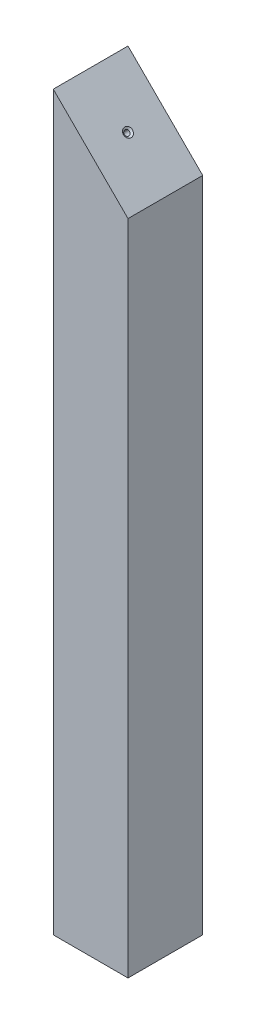
ISO-10303-21;
HEADER;
FILE_DESCRIPTION(('STEP AP214'),'2;1');
FILE_NAME('part.step','',(''),(''),'','','');
FILE_SCHEMA(('AUTOMOTIVE_DESIGN { 1 0 10303 214 1 1 1 1 }'));
ENDSEC;
DATA;
#1=APPLICATION_CONTEXT('core data for automotive mechanical design processes');
#2=APPLICATION_PROTOCOL_DEFINITION('international standard','automotive_design',2000,#1);
#3=PRODUCT_CONTEXT('',#1,'mechanical');
#4=PRODUCT('Part','Part','',(#3));
#5=PRODUCT_RELATED_PRODUCT_CATEGORY('part','',(#4));
#6=PRODUCT_DEFINITION_FORMATION('','',#4);
#7=PRODUCT_DEFINITION_CONTEXT('part definition',#1,'design');
#8=PRODUCT_DEFINITION('design','',#6,#7);
#9=PRODUCT_DEFINITION_SHAPE('','',#8);
#10=(LENGTH_UNIT() NAMED_UNIT(*) SI_UNIT(.MILLI.,.METRE.));
#11=(NAMED_UNIT(*) PLANE_ANGLE_UNIT() SI_UNIT($,.RADIAN.));
#12=(NAMED_UNIT(*) SI_UNIT($,.STERADIAN.) SOLID_ANGLE_UNIT());
#13=UNCERTAINTY_MEASURE_WITH_UNIT(LENGTH_MEASURE(1.E-05),#10,'distance_accuracy_value','');
#14=(GEOMETRIC_REPRESENTATION_CONTEXT(3) GLOBAL_UNCERTAINTY_ASSIGNED_CONTEXT((#13)) GLOBAL_UNIT_ASSIGNED_CONTEXT((#10,
#11,#12)) REPRESENTATION_CONTEXT('',''));
#15=CARTESIAN_POINT('',(0.,0.,0.));
#16=DIRECTION('',(0.,0.,1.));
#17=DIRECTION('',(1.,0.,0.));
#18=AXIS2_PLACEMENT_3D('',#15,#16,#17);
#19=CARTESIAN_POINT('',(12.7,124.485,-12.7));
#20=DIRECTION('',(-1.,0.,0.));
#21=DIRECTION('',(0.,0.,1.));
#22=AXIS2_PLACEMENT_3D('',#19,#20,#21);
#23=PLANE('',#22);
#24=DIRECTION('',(0.,-1.,0.));
#25=VECTOR('',#24,1.);
#26=CARTESIAN_POINT('',(12.7,124.485,-12.7));
#27=LINE('',#26,#25);
#28=CARTESIAN_POINT('',(12.7,99.0850000000001,-12.7));
#29=VERTEX_POINT('',#28);
#30=CARTESIAN_POINT('',(12.7,-124.485,-12.7));
#31=VERTEX_POINT('',#30);
#32=EDGE_CURVE('E11',#29,#31,#27,.T.);
#33=ORIENTED_EDGE('',*,*,#32,.F.);
#34=DIRECTION('',(0.,0.,1.));
#35=VECTOR('',#34,1.);
#36=CARTESIAN_POINT('',(12.7,99.0850000000001,-12.7));
#37=LINE('',#36,#35);
#38=CARTESIAN_POINT('',(12.7,99.0850000000001,12.7));
#39=VERTEX_POINT('',#38);
#40=EDGE_CURVE('E103',#29,#39,#37,.T.);
#41=ORIENTED_EDGE('',*,*,#40,.T.);
#42=DIRECTION('',(0.,-1.,0.));
#43=VECTOR('',#42,1.);
#44=CARTESIAN_POINT('',(12.7,124.485,12.7));
#45=LINE('',#44,#43);
#46=CARTESIAN_POINT('',(12.7,-124.485,12.7));
#47=VERTEX_POINT('',#46);
#48=EDGE_CURVE('E89',#39,#47,#45,.T.);
#49=ORIENTED_EDGE('',*,*,#48,.T.);
#50=DIRECTION('',(0.,0.,-1.));
#51=VECTOR('',#50,1.);
#52=CARTESIAN_POINT('',(12.7,-124.485,-12.7));
#53=LINE('',#52,#51);
#54=EDGE_CURVE('E93',#47,#31,#53,.T.);
#55=ORIENTED_EDGE('',*,*,#54,.T.);
#56=EDGE_LOOP('',(#33,#41,#49,#55));
#57=FACE_BOUND('',#56,.T.);
#58=ADVANCED_FACE('F37',(#57),#23,.F.);
#59=CARTESIAN_POINT('',(-12.7,124.485,-12.7));
#60=DIRECTION('',(0.,0.,1.));
#61=DIRECTION('',(1.,0.,0.));
#62=AXIS2_PLACEMENT_3D('',#59,#60,#61);
#63=PLANE('',#62);
#64=DIRECTION('',(0.,-1.,0.));
#65=VECTOR('',#64,1.);
#66=CARTESIAN_POINT('',(-12.7,124.485,-12.7));
#67=LINE('',#66,#65);
#68=CARTESIAN_POINT('',(-12.7,124.485,-12.7));
#69=VERTEX_POINT('',#68);
#70=CARTESIAN_POINT('',(-12.7,-124.485,-12.7));
#71=VERTEX_POINT('',#70);
#72=EDGE_CURVE('E45',#69,#71,#67,.T.);
#73=ORIENTED_EDGE('',*,*,#72,.F.);
#74=DIRECTION('',(0.707106781186549,-0.707106781186546,0.));
#75=VECTOR('',#74,1.);
#76=CARTESIAN_POINT('',(-12.7,124.485,-12.7));
#77=LINE('',#76,#75);
#78=EDGE_CURVE('E52',#69,#29,#77,.T.);
#79=ORIENTED_EDGE('',*,*,#78,.T.);
#80=ORIENTED_EDGE('',*,*,#32,.T.);
#81=DIRECTION('',(-1.,0.,0.));
#82=VECTOR('',#81,1.);
#83=CARTESIAN_POINT('',(-12.7,-124.485,-12.7));
#84=LINE('',#83,#82);
#85=EDGE_CURVE('E79',#31,#71,#84,.T.);
#86=ORIENTED_EDGE('',*,*,#85,.T.);
#87=EDGE_LOOP('',(#73,#79,#80,#86));
#88=FACE_BOUND('',#87,.T.);
#89=ADVANCED_FACE('F141',(#88),#63,.F.);
#90=CARTESIAN_POINT('',(-12.7,124.485,-12.7));
#91=DIRECTION('',(1.,0.,0.));
#92=DIRECTION('',(0.,0.,-1.));
#93=AXIS2_PLACEMENT_3D('',#90,#91,#92);
#94=PLANE('',#93);
#95=DIRECTION('',(0.,0.,1.));
#96=VECTOR('',#95,1.);
#97=CARTESIAN_POINT('',(-12.7,-124.485,-12.7));
#98=LINE('',#97,#96);
#99=CARTESIAN_POINT('',(-12.7,-124.485,12.7));
#100=VERTEX_POINT('',#99);
#101=EDGE_CURVE('E69',#71,#100,#98,.T.);
#102=ORIENTED_EDGE('',*,*,#101,.T.);
#103=DIRECTION('',(0.,-1.,0.));
#104=VECTOR('',#103,1.);
#105=CARTESIAN_POINT('',(-12.7,124.485,12.7));
#106=LINE('',#105,#104);
#107=CARTESIAN_POINT('',(-12.7,124.485,12.7));
#108=VERTEX_POINT('',#107);
#109=EDGE_CURVE('E74',#108,#100,#106,.T.);
#110=ORIENTED_EDGE('',*,*,#109,.F.);
#111=DIRECTION('',(0.,0.,1.));
#112=VECTOR('',#111,1.);
#113=CARTESIAN_POINT('',(-12.7,124.485,-12.7));
#114=LINE('',#113,#112);
#115=EDGE_CURVE('E94',#69,#108,#114,.T.);
#116=ORIENTED_EDGE('',*,*,#115,.F.);
#117=ORIENTED_EDGE('',*,*,#72,.T.);
#118=EDGE_LOOP('',(#102,#110,#116,#117));
#119=FACE_BOUND('',#118,.T.);
#120=ADVANCED_FACE('F71',(#119),#94,.F.);
#121=CARTESIAN_POINT('',(-12.7,124.485,12.7));
#122=DIRECTION('',(0.,0.,-1.));
#123=DIRECTION('',(-1.,0.,0.));
#124=AXIS2_PLACEMENT_3D('',#121,#122,#123);
#125=PLANE('',#124);
#126=ORIENTED_EDGE('',*,*,#48,.F.);
#127=DIRECTION('',(0.707106781186549,-0.707106781186546,0.));
#128=VECTOR('',#127,1.);
#129=CARTESIAN_POINT('',(-12.7,124.485,12.7));
#130=LINE('',#129,#128);
#131=EDGE_CURVE('E88',#108,#39,#130,.T.);
#132=ORIENTED_EDGE('',*,*,#131,.F.);
#133=ORIENTED_EDGE('',*,*,#109,.T.);
#134=DIRECTION('',(1.,0.,0.));
#135=VECTOR('',#134,1.);
#136=CARTESIAN_POINT('',(-12.7,-124.485,12.7));
#137=LINE('',#136,#135);
#138=EDGE_CURVE('E78',#100,#47,#137,.T.);
#139=ORIENTED_EDGE('',*,*,#138,.T.);
#140=EDGE_LOOP('',(#126,#132,#133,#139));
#141=FACE_BOUND('',#140,.T.);
#142=ADVANCED_FACE('F85',(#141),#125,.F.);
#143=CARTESIAN_POINT('',(0.,-124.485,0.));
#144=DIRECTION('',(0.,1.,0.));
#145=DIRECTION('',(0.,0.,1.));
#146=AXIS2_PLACEMENT_3D('',#143,#144,#145);
#147=PLANE('',#146);
#148=CARTESIAN_POINT('',(0.,-124.485,0.));
#149=DIRECTION('',(0.,-1.,0.));
#150=DIRECTION('',(0.,0.,-1.));
#151=AXIS2_PLACEMENT_3D('',#148,#149,#150);
#152=CIRCLE('',#151,1.5113);
#153=CARTESIAN_POINT('',(0.,-124.485,-1.5113));
#154=VERTEX_POINT('',#153);
#155=EDGE_CURVE('E131',#154,#154,#152,.T.);
#156=ORIENTED_EDGE('',*,*,#155,.F.);
#157=EDGE_LOOP('',(#156));
#158=FACE_BOUND('',#157,.T.);
#159=ORIENTED_EDGE('',*,*,#54,.F.);
#160=ORIENTED_EDGE('',*,*,#138,.F.);
#161=ORIENTED_EDGE('',*,*,#101,.F.);
#162=ORIENTED_EDGE('',*,*,#85,.F.);
#163=EDGE_LOOP('',(#159,#160,#161,#162));
#164=FACE_BOUND('',#163,.T.);
#165=ADVANCED_FACE('F91',(#158,#164),#147,.F.);
#166=CARTESIAN_POINT('',(0.,-104.485,0.));
#167=DIRECTION('',(0.,-1.,0.));
#168=DIRECTION('',(0.,0.,-1.));
#169=AXIS2_PLACEMENT_3D('',#166,#167,#168);
#170=CONICAL_SURFACE('',#169,0.595629999999985,1.02974425867665);
#171=CARTESIAN_POINT('',(0.,-104.127109389489,0.));
#172=VERTEX_POINT('',#171);
#173=VERTEX_LOOP('',#172);
#174=FACE_BOUND('',#173,.T.);
#175=CARTESIAN_POINT('',(0.,-104.485,0.));
#176=DIRECTION('',(0.,-1.,0.));
#177=DIRECTION('',(0.,0.,-1.));
#178=AXIS2_PLACEMENT_3D('',#175,#176,#177);
#179=CIRCLE('',#178,0.595629999999985);
#180=CARTESIAN_POINT('',(0.,-104.485,-0.595629999999985));
#181=VERTEX_POINT('',#180);
#182=EDGE_CURVE('E137',#181,#181,#179,.T.);
#183=ORIENTED_EDGE('',*,*,#182,.T.);
#184=EDGE_LOOP('',(#183));
#185=FACE_BOUND('',#184,.T.);
#186=ADVANCED_FACE('F166',(#174,#185),#170,.F.);
#187=CARTESIAN_POINT('',(0.,-124.485,0.));
#188=DIRECTION('',(0.,-1.,0.));
#189=DIRECTION('',(0.,0.,-1.));
#190=AXIS2_PLACEMENT_3D('',#187,#188,#189);
#191=CYLINDRICAL_SURFACE('',#190,0.595629999999987);
#192=ORIENTED_EDGE('',*,*,#182,.F.);
#193=EDGE_LOOP('',(#192));
#194=FACE_BOUND('',#193,.T.);
#195=CARTESIAN_POINT('',(0.,-123.71666164072,0.));
#196=DIRECTION('',(0.,-1.,0.));
#197=DIRECTION('',(0.,0.,-1.));
#198=AXIS2_PLACEMENT_3D('',#195,#196,#197);
#199=CIRCLE('',#198,0.595629999999989);
#200=CARTESIAN_POINT('',(0.,-123.71666164072,-0.595629999999989));
#201=VERTEX_POINT('',#200);
#202=EDGE_CURVE('E134',#201,#201,#199,.T.);
#203=ORIENTED_EDGE('',*,*,#202,.T.);
#204=EDGE_LOOP('',(#203));
#205=FACE_BOUND('',#204,.T.);
#206=ADVANCED_FACE('F149',(#194,#205),#191,.F.);
#207=CARTESIAN_POINT('',(0.,-124.485,0.));
#208=DIRECTION('',(0.,-1.,0.));
#209=DIRECTION('',(0.,0.,-1.));
#210=AXIS2_PLACEMENT_3D('',#207,#208,#209);
#211=CONICAL_SURFACE('',#210,1.5113,0.872664625997162);
#212=ORIENTED_EDGE('',*,*,#202,.F.);
#213=EDGE_LOOP('',(#212));
#214=FACE_BOUND('',#213,.T.);
#215=ORIENTED_EDGE('',*,*,#155,.T.);
#216=EDGE_LOOP('',(#215));
#217=FACE_BOUND('',#216,.T.);
#218=ADVANCED_FACE('F143',(#214,#217),#211,.F.);
#219=CARTESIAN_POINT('',(-12.7,124.485,-12.7));
#220=DIRECTION('',(-0.707106781186546,-0.707106781186549,0.));
#221=DIRECTION('',(0.707106781186549,-0.707106781186546,0.));
#222=AXIS2_PLACEMENT_3D('',#219,#220,#221);
#223=PLANE('',#222);
#224=CARTESIAN_POINT('',(0.,111.785,0.));
#225=DIRECTION('',(0.707106781186546,0.707106781186549,0.));
#226=DIRECTION('',(-0.707106781186549,0.707106781186546,0.));
#227=AXIS2_PLACEMENT_3D('',#224,#225,#226);
#228=CIRCLE('',#227,1.5113);
#229=CARTESIAN_POINT('',(-1.06865047840724,112.853650478407,0.));
#230=VERTEX_POINT('',#229);
#231=EDGE_CURVE('E125',#230,#230,#228,.T.);
#232=ORIENTED_EDGE('',*,*,#231,.F.);
#233=EDGE_LOOP('',(#232));
#234=FACE_BOUND('',#233,.T.);
#235=ORIENTED_EDGE('',*,*,#40,.F.);
#236=ORIENTED_EDGE('',*,*,#78,.F.);
#237=ORIENTED_EDGE('',*,*,#115,.T.);
#238=ORIENTED_EDGE('',*,*,#131,.T.);
#239=EDGE_LOOP('',(#235,#236,#237,#238));
#240=FACE_BOUND('',#239,.T.);
#241=ADVANCED_FACE('F115',(#234,#240),#223,.F.);
#242=CARTESIAN_POINT('',(-7.07106781186547,104.713932188135,0.));
#243=DIRECTION('',(0.707106781186546,0.707106781186549,0.));
#244=DIRECTION('',(-0.707106781186549,0.707106781186546,0.));
#245=AXIS2_PLACEMENT_3D('',#242,#243,#244);
#246=CONICAL_SURFACE('',#245,0.888999999999996,1.02974425867666);
#247=CARTESIAN_POINT('',(-7.44877956950068,104.336220430499,0.));
#248=VERTEX_POINT('',#247);
#249=VERTEX_LOOP('',#248);
#250=FACE_BOUND('',#249,.T.);
#251=CARTESIAN_POINT('',(-7.07106781186547,104.713932188135,0.));
#252=DIRECTION('',(0.707106781186546,0.707106781186549,0.));
#253=DIRECTION('',(-0.707106781186549,0.707106781186546,0.));
#254=AXIS2_PLACEMENT_3D('',#251,#252,#253);
#255=CIRCLE('',#254,0.888999999999996);
#256=CARTESIAN_POINT('',(-7.69968574034031,105.342550116609,0.));
#257=VERTEX_POINT('',#256);
#258=EDGE_CURVE('E119',#257,#257,#255,.T.);
#259=ORIENTED_EDGE('',*,*,#258,.T.);
#260=EDGE_LOOP('',(#259));
#261=FACE_BOUND('',#260,.T.);
#262=ADVANCED_FACE('F111',(#250,#261),#246,.F.);
#263=CARTESIAN_POINT('',(0.,111.785,0.));
#264=DIRECTION('',(0.707106781186546,0.707106781186549,0.));
#265=DIRECTION('',(-0.707106781186549,0.707106781186546,0.));
#266=AXIS2_PLACEMENT_3D('',#263,#264,#265);
#267=CYLINDRICAL_SURFACE('',#266,0.888999999999996);
#268=ORIENTED_EDGE('',*,*,#258,.F.);
#269=EDGE_LOOP('',(#268));
#270=FACE_BOUND('',#269,.T.);
#271=CARTESIAN_POINT('',(-0.369231150354273,111.415768849646,0.));
#272=DIRECTION('',(0.707106781186546,0.707106781186549,0.));
#273=DIRECTION('',(-0.707106781186549,0.707106781186546,0.));
#274=AXIS2_PLACEMENT_3D('',#271,#272,#273);
#275=CIRCLE('',#274,0.888999999999996);
#276=CARTESIAN_POINT('',(-0.997849078829112,112.044386778121,0.));
#277=VERTEX_POINT('',#276);
#278=EDGE_CURVE('E121',#277,#277,#275,.T.);
#279=ORIENTED_EDGE('',*,*,#278,.T.);
#280=EDGE_LOOP('',(#279));
#281=FACE_BOUND('',#280,.T.);
#282=ADVANCED_FACE('F114',(#270,#281),#267,.F.);
#283=CARTESIAN_POINT('',(0.,111.785,0.));
#284=DIRECTION('',(0.707106781186546,0.707106781186549,0.));
#285=DIRECTION('',(-0.707106781186549,0.707106781186546,0.));
#286=AXIS2_PLACEMENT_3D('',#283,#284,#285);
#287=CONICAL_SURFACE('',#286,1.5113,0.872664625997165);
#288=ORIENTED_EDGE('',*,*,#278,.F.);
#289=EDGE_LOOP('',(#288));
#290=FACE_BOUND('',#289,.T.);
#291=ORIENTED_EDGE('',*,*,#231,.T.);
#292=EDGE_LOOP('',(#291));
#293=FACE_BOUND('',#292,.T.);
#294=ADVANCED_FACE('F230',(#290,#293),#287,.F.);
#295=CLOSED_SHELL('',(#58,#89,#120,#142,#165,#186,#206,#218,#241,#262,#282,#294));
#296=MANIFOLD_SOLID_BREP('B2',#295);
#297=ADVANCED_BREP_SHAPE_REPRESENTATION('',(#18,#296),#14);
#298=SHAPE_DEFINITION_REPRESENTATION(#9,#297);
ENDSEC;
END-ISO-10303-21;
